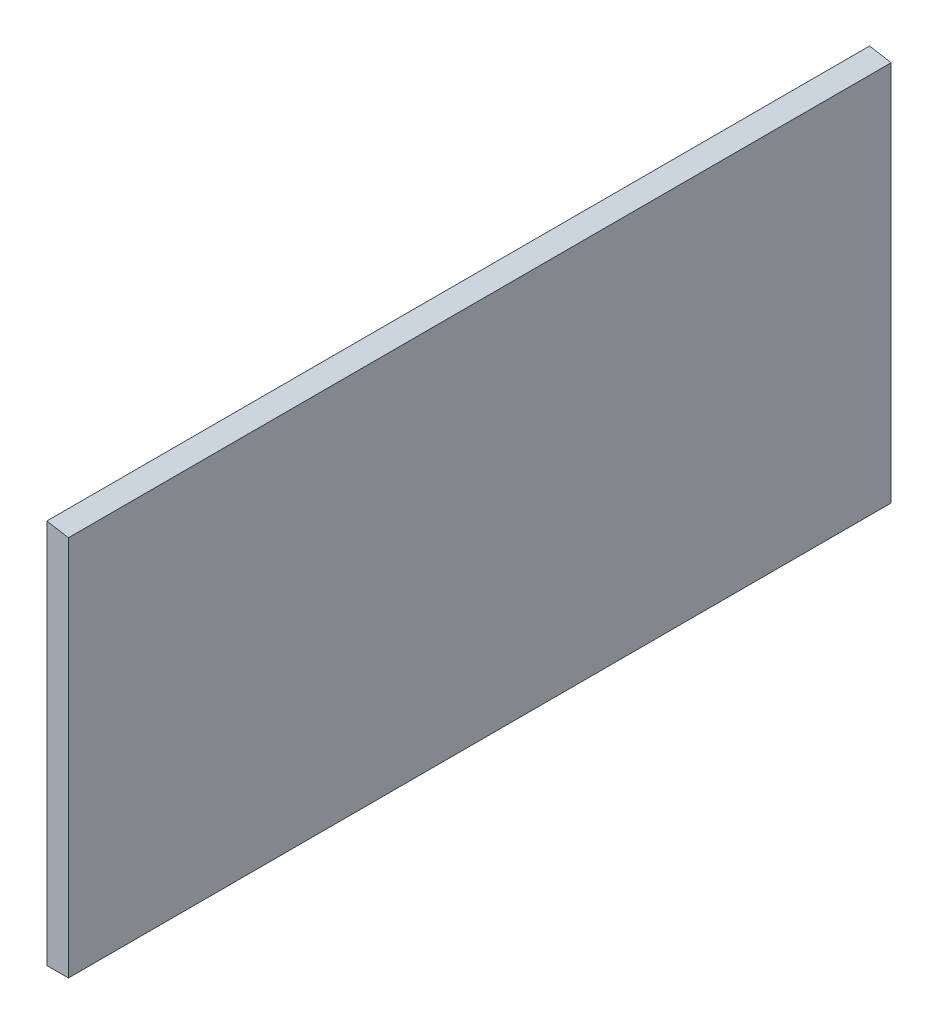
ISO-10303-21;
HEADER;
FILE_DESCRIPTION(('STEP AP214'),'2;1');
FILE_NAME('part.step','',(''),(''),'','','');
FILE_SCHEMA(('AUTOMOTIVE_DESIGN { 1 0 10303 214 1 1 1 1 }'));
ENDSEC;
DATA;
#1=APPLICATION_CONTEXT('core data for automotive mechanical design processes');
#2=APPLICATION_PROTOCOL_DEFINITION('international standard','automotive_design',2000,#1);
#3=PRODUCT_CONTEXT('',#1,'mechanical');
#4=PRODUCT('Part','Part','',(#3));
#5=PRODUCT_RELATED_PRODUCT_CATEGORY('part','',(#4));
#6=PRODUCT_DEFINITION_FORMATION('','',#4);
#7=PRODUCT_DEFINITION_CONTEXT('part definition',#1,'design');
#8=PRODUCT_DEFINITION('design','',#6,#7);
#9=PRODUCT_DEFINITION_SHAPE('','',#8);
#10=(LENGTH_UNIT() NAMED_UNIT(*) SI_UNIT(.MILLI.,.METRE.));
#11=(NAMED_UNIT(*) PLANE_ANGLE_UNIT() SI_UNIT($,.RADIAN.));
#12=(NAMED_UNIT(*) SI_UNIT($,.STERADIAN.) SOLID_ANGLE_UNIT());
#13=UNCERTAINTY_MEASURE_WITH_UNIT(LENGTH_MEASURE(1.E-05),#10,'distance_accuracy_value','');
#14=(GEOMETRIC_REPRESENTATION_CONTEXT(3) GLOBAL_UNCERTAINTY_ASSIGNED_CONTEXT((#13)) GLOBAL_UNIT_ASSIGNED_CONTEXT((#10,
#11,#12)) REPRESENTATION_CONTEXT('',''));
#15=CARTESIAN_POINT('',(0.,0.,0.));
#16=DIRECTION('',(0.,0.,1.));
#17=DIRECTION('',(1.,0.,0.));
#18=AXIS2_PLACEMENT_3D('',#15,#16,#17);
#19=CARTESIAN_POINT('',(0.,0.,57.094));
#20=DIRECTION('',(0.,1.,0.));
#21=DIRECTION('',(0.,0.,1.));
#22=AXIS2_PLACEMENT_3D('',#19,#20,#21);
#23=PLANE('',#22);
#24=DIRECTION('',(1.,0.,0.));
#25=VECTOR('',#24,1.);
#26=CARTESIAN_POINT('',(0.,0.,-57.094));
#27=LINE('',#26,#25);
#28=CARTESIAN_POINT('',(0.,0.,-57.094));
#29=VERTEX_POINT('',#28);
#30=CARTESIAN_POINT('',(3.,0.,-57.094));
#31=VERTEX_POINT('',#30);
#32=EDGE_CURVE('E95',#29,#31,#27,.T.);
#33=ORIENTED_EDGE('',*,*,#32,.T.);
#34=DIRECTION('',(0.,0.,-1.));
#35=VECTOR('',#34,1.);
#36=CARTESIAN_POINT('',(3.,0.,57.094));
#37=LINE('',#36,#35);
#38=CARTESIAN_POINT('',(3.,0.,57.094));
#39=VERTEX_POINT('',#38);
#40=EDGE_CURVE('E11',#39,#31,#37,.T.);
#41=ORIENTED_EDGE('',*,*,#40,.F.);
#42=DIRECTION('',(1.,0.,0.));
#43=VECTOR('',#42,1.);
#44=CARTESIAN_POINT('',(0.,0.,57.094));
#45=LINE('',#44,#43);
#46=CARTESIAN_POINT('',(0.,0.,57.094));
#47=VERTEX_POINT('',#46);
#48=EDGE_CURVE('E83',#47,#39,#45,.T.);
#49=ORIENTED_EDGE('',*,*,#48,.F.);
#50=DIRECTION('',(0.,0.,-1.));
#51=VECTOR('',#50,1.);
#52=CARTESIAN_POINT('',(0.,0.,57.094));
#53=LINE('',#52,#51);
#54=EDGE_CURVE('E91',#47,#29,#53,.T.);
#55=ORIENTED_EDGE('',*,*,#54,.T.);
#56=EDGE_LOOP('',(#33,#41,#49,#55));
#57=FACE_BOUND('',#56,.T.);
#58=ADVANCED_FACE('F32',(#57),#23,.F.);
#59=CARTESIAN_POINT('',(3.,0.,57.094));
#60=DIRECTION('',(-1.,0.,0.));
#61=DIRECTION('',(0.,0.,1.));
#62=AXIS2_PLACEMENT_3D('',#59,#60,#61);
#63=PLANE('',#62);
#64=DIRECTION('',(0.,1.,0.));
#65=VECTOR('',#64,1.);
#66=CARTESIAN_POINT('',(3.,0.,-57.094));
#67=LINE('',#66,#65);
#68=CARTESIAN_POINT('',(3.,52.9185687940159,-57.094));
#69=VERTEX_POINT('',#68);
#70=EDGE_CURVE('E87',#31,#69,#67,.T.);
#71=ORIENTED_EDGE('',*,*,#70,.T.);
#72=DIRECTION('',(0.,0.,-1.));
#73=VECTOR('',#72,1.);
#74=CARTESIAN_POINT('',(3.,52.9185687940159,57.094));
#75=LINE('',#74,#73);
#76=CARTESIAN_POINT('',(3.,52.9185687940159,57.094));
#77=VERTEX_POINT('',#76);
#78=EDGE_CURVE('E40',#77,#69,#75,.T.);
#79=ORIENTED_EDGE('',*,*,#78,.F.);
#80=DIRECTION('',(0.,1.,0.));
#81=VECTOR('',#80,1.);
#82=CARTESIAN_POINT('',(3.,0.,57.094));
#83=LINE('',#82,#81);
#84=EDGE_CURVE('E78',#39,#77,#83,.T.);
#85=ORIENTED_EDGE('',*,*,#84,.F.);
#86=ORIENTED_EDGE('',*,*,#40,.T.);
#87=EDGE_LOOP('',(#71,#79,#85,#86));
#88=FACE_BOUND('',#87,.T.);
#89=ADVANCED_FACE('F86',(#88),#63,.F.);
#90=CARTESIAN_POINT('',(3.,52.9185687940159,57.094));
#91=DIRECTION('',(-0.167412382545604,-0.985886958109501,0.));
#92=DIRECTION('',(0.985886958109501,-0.167412382545604,0.));
#93=AXIS2_PLACEMENT_3D('',#90,#91,#92);
#94=PLANE('',#93);
#95=DIRECTION('',(-0.9858869581095,0.167412382545604,0.));
#96=VECTOR('',#95,1.);
#97=CARTESIAN_POINT('',(3.,52.9185687940159,-57.094));
#98=LINE('',#97,#96);
#99=CARTESIAN_POINT('',(0.,53.4279955021244,-57.094));
#100=VERTEX_POINT('',#99);
#101=EDGE_CURVE('E65',#69,#100,#98,.T.);
#102=ORIENTED_EDGE('',*,*,#101,.T.);
#103=DIRECTION('',(0.,0.,-1.));
#104=VECTOR('',#103,1.);
#105=CARTESIAN_POINT('',(0.,53.4279955021244,57.094));
#106=LINE('',#105,#104);
#107=CARTESIAN_POINT('',(0.,53.4279955021244,57.094));
#108=VERTEX_POINT('',#107);
#109=EDGE_CURVE('E88',#108,#100,#106,.T.);
#110=ORIENTED_EDGE('',*,*,#109,.F.);
#111=DIRECTION('',(-0.9858869581095,0.167412382545604,0.));
#112=VECTOR('',#111,1.);
#113=CARTESIAN_POINT('',(3.,52.9185687940159,57.094));
#114=LINE('',#113,#112);
#115=EDGE_CURVE('E81',#77,#108,#114,.T.);
#116=ORIENTED_EDGE('',*,*,#115,.F.);
#117=ORIENTED_EDGE('',*,*,#78,.T.);
#118=EDGE_LOOP('',(#102,#110,#116,#117));
#119=FACE_BOUND('',#118,.T.);
#120=ADVANCED_FACE('F89',(#119),#94,.F.);
#121=CARTESIAN_POINT('',(0.,53.4279955021244,57.094));
#122=DIRECTION('',(1.,0.,0.));
#123=DIRECTION('',(0.,1.,0.));
#124=AXIS2_PLACEMENT_3D('',#121,#122,#123);
#125=PLANE('',#124);
#126=DIRECTION('',(0.,-1.,0.));
#127=VECTOR('',#126,1.);
#128=CARTESIAN_POINT('',(0.,53.4279955021244,-57.094));
#129=LINE('',#128,#127);
#130=EDGE_CURVE('E71',#100,#29,#129,.T.);
#131=ORIENTED_EDGE('',*,*,#130,.T.);
#132=ORIENTED_EDGE('',*,*,#54,.F.);
#133=DIRECTION('',(0.,-1.,0.));
#134=VECTOR('',#133,1.);
#135=CARTESIAN_POINT('',(0.,53.4279955021244,57.094));
#136=LINE('',#135,#134);
#137=EDGE_CURVE('E48',#108,#47,#136,.T.);
#138=ORIENTED_EDGE('',*,*,#137,.F.);
#139=ORIENTED_EDGE('',*,*,#109,.T.);
#140=EDGE_LOOP('',(#131,#132,#138,#139));
#141=FACE_BOUND('',#140,.T.);
#142=ADVANCED_FACE('F102',(#141),#125,.F.);
#143=CARTESIAN_POINT('',(0.,0.,57.094));
#144=DIRECTION('',(0.,0.,1.));
#145=DIRECTION('',(1.,0.,0.));
#146=AXIS2_PLACEMENT_3D('',#143,#144,#145);
#147=PLANE('',#146);
#148=ORIENTED_EDGE('',*,*,#48,.T.);
#149=ORIENTED_EDGE('',*,*,#84,.T.);
#150=ORIENTED_EDGE('',*,*,#115,.T.);
#151=ORIENTED_EDGE('',*,*,#137,.T.);
#152=EDGE_LOOP('',(#148,#149,#150,#151));
#153=FACE_BOUND('',#152,.T.);
#154=ADVANCED_FACE('F79',(#153),#147,.T.);
#155=CARTESIAN_POINT('',(0.,0.,-57.094));
#156=DIRECTION('',(0.,0.,1.));
#157=DIRECTION('',(1.,0.,0.));
#158=AXIS2_PLACEMENT_3D('',#155,#156,#157);
#159=PLANE('',#158);
#160=ORIENTED_EDGE('',*,*,#32,.F.);
#161=ORIENTED_EDGE('',*,*,#130,.F.);
#162=ORIENTED_EDGE('',*,*,#101,.F.);
#163=ORIENTED_EDGE('',*,*,#70,.F.);
#164=EDGE_LOOP('',(#160,#161,#162,#163));
#165=FACE_BOUND('',#164,.T.);
#166=ADVANCED_FACE('F105',(#165),#159,.F.);
#167=CLOSED_SHELL('',(#58,#89,#120,#142,#154,#166));
#168=MANIFOLD_SOLID_BREP('B2',#167);
#169=ADVANCED_BREP_SHAPE_REPRESENTATION('',(#18,#168),#14);
#170=SHAPE_DEFINITION_REPRESENTATION(#9,#169);
ENDSEC;
END-ISO-10303-21;
